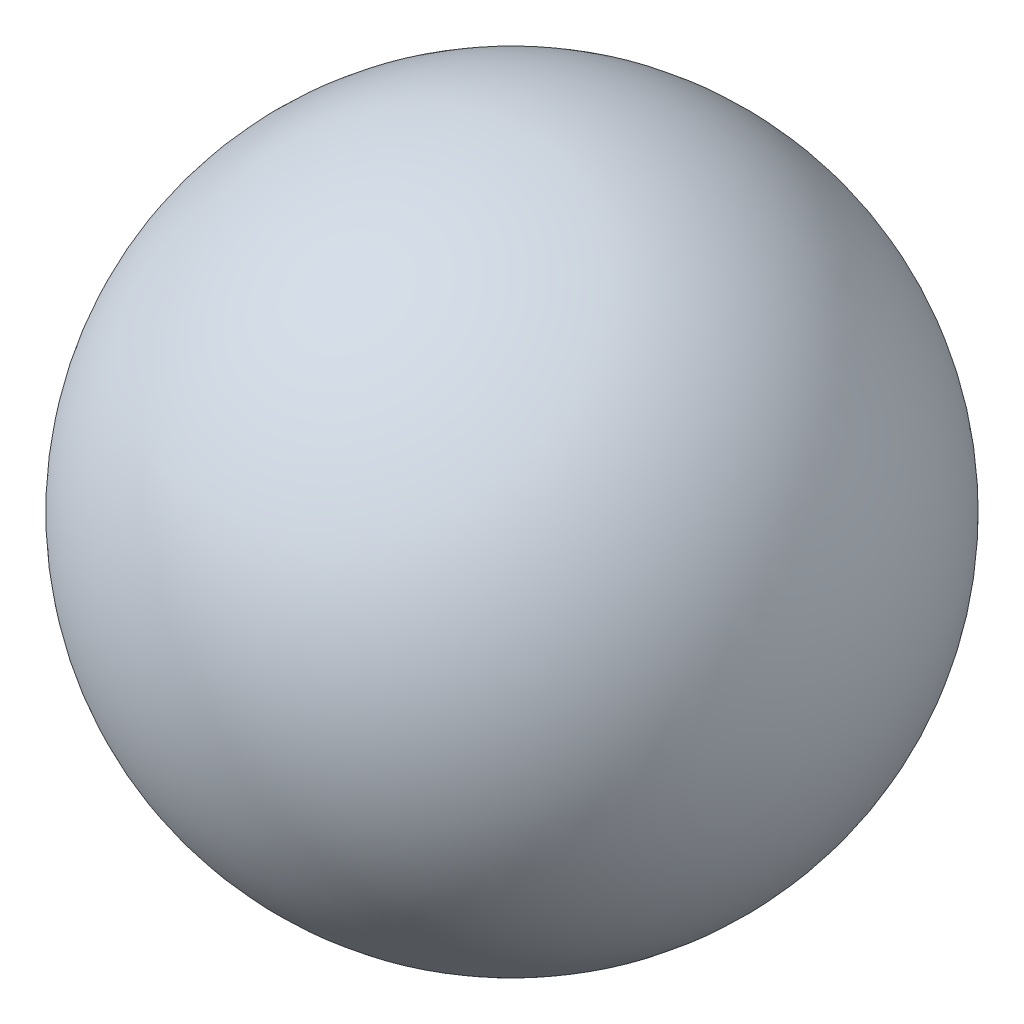
ISO-10303-21;
HEADER;
FILE_DESCRIPTION(('STEP AP214'),'2;1');
FILE_NAME('part.step','',(''),(''),'','','');
FILE_SCHEMA(('AUTOMOTIVE_DESIGN { 1 0 10303 214 1 1 1 1 }'));
ENDSEC;
DATA;
#1=APPLICATION_CONTEXT('core data for automotive mechanical design processes');
#2=APPLICATION_PROTOCOL_DEFINITION('international standard','automotive_design',2000,#1);
#3=PRODUCT_CONTEXT('',#1,'mechanical');
#4=PRODUCT('Part','Part','',(#3));
#5=PRODUCT_RELATED_PRODUCT_CATEGORY('part','',(#4));
#6=PRODUCT_DEFINITION_FORMATION('','',#4);
#7=PRODUCT_DEFINITION_CONTEXT('part definition',#1,'design');
#8=PRODUCT_DEFINITION('design','',#6,#7);
#9=PRODUCT_DEFINITION_SHAPE('','',#8);
#10=(LENGTH_UNIT() NAMED_UNIT(*) SI_UNIT(.MILLI.,.METRE.));
#11=(NAMED_UNIT(*) PLANE_ANGLE_UNIT() SI_UNIT($,.RADIAN.));
#12=(NAMED_UNIT(*) SI_UNIT($,.STERADIAN.) SOLID_ANGLE_UNIT());
#13=UNCERTAINTY_MEASURE_WITH_UNIT(LENGTH_MEASURE(1.E-05),#10,'distance_accuracy_value','');
#14=(GEOMETRIC_REPRESENTATION_CONTEXT(3) GLOBAL_UNCERTAINTY_ASSIGNED_CONTEXT((#13)) GLOBAL_UNIT_ASSIGNED_CONTEXT((#10,
#11,#12)) REPRESENTATION_CONTEXT('',''));
#15=CARTESIAN_POINT('',(0.,0.,0.));
#16=DIRECTION('',(0.,0.,1.));
#17=DIRECTION('',(1.,0.,0.));
#18=AXIS2_PLACEMENT_3D('',#15,#16,#17);
#19=CARTESIAN_POINT('',(0.,0.,0.));
#20=DIRECTION('',(0.,-1.,0.));
#21=DIRECTION('',(-1.,0.,0.));
#22=AXIS2_PLACEMENT_3D('',#19,#20,#21);
#23=SPHERICAL_SURFACE('',#22,203.2);
#24=CARTESIAN_POINT('',(0.,-203.2,0.));
#25=VERTEX_POINT('',#24);
#26=VERTEX_LOOP('',#25);
#27=FACE_BOUND('',#26,.T.);
#28=ADVANCED_FACE('F37',(#27),#23,.T.);
#29=CLOSED_SHELL('',(#28));
#30=MANIFOLD_SOLID_BREP('B2',#29);
#31=ADVANCED_BREP_SHAPE_REPRESENTATION('',(#18,#30),#14);
#32=SHAPE_DEFINITION_REPRESENTATION(#9,#31);
ENDSEC;
END-ISO-10303-21;
